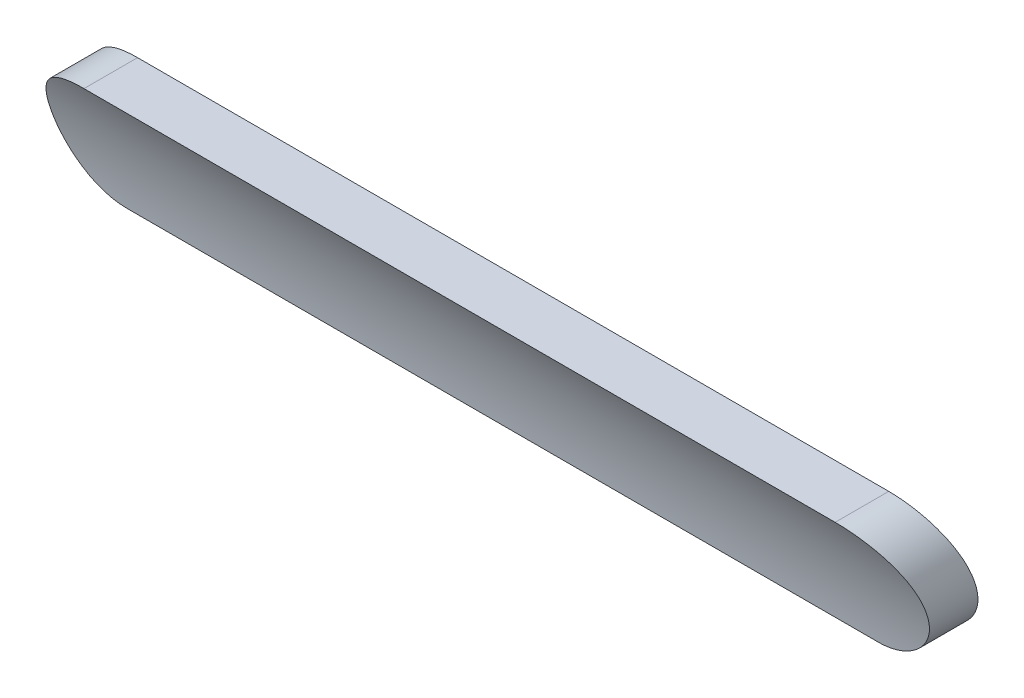
ISO-10303-21;
HEADER;
FILE_DESCRIPTION(('STEP AP214'),'2;1');
FILE_NAME('part.step','',(''),(''),'','','');
FILE_SCHEMA(('AUTOMOTIVE_DESIGN { 1 0 10303 214 1 1 1 1 }'));
ENDSEC;
DATA;
#1=APPLICATION_CONTEXT('core data for automotive mechanical design processes');
#2=APPLICATION_PROTOCOL_DEFINITION('international standard','automotive_design',2000,#1);
#3=PRODUCT_CONTEXT('',#1,'mechanical');
#4=PRODUCT('Part','Part','',(#3));
#5=PRODUCT_RELATED_PRODUCT_CATEGORY('part','',(#4));
#6=PRODUCT_DEFINITION_FORMATION('','',#4);
#7=PRODUCT_DEFINITION_CONTEXT('part definition',#1,'design');
#8=PRODUCT_DEFINITION('design','',#6,#7);
#9=PRODUCT_DEFINITION_SHAPE('','',#8);
#10=(LENGTH_UNIT() NAMED_UNIT(*) SI_UNIT(.MILLI.,.METRE.));
#11=(NAMED_UNIT(*) PLANE_ANGLE_UNIT() SI_UNIT($,.RADIAN.));
#12=(NAMED_UNIT(*) SI_UNIT($,.STERADIAN.) SOLID_ANGLE_UNIT());
#13=UNCERTAINTY_MEASURE_WITH_UNIT(LENGTH_MEASURE(1.E-05),#10,'distance_accuracy_value','');
#14=(GEOMETRIC_REPRESENTATION_CONTEXT(3) GLOBAL_UNCERTAINTY_ASSIGNED_CONTEXT((#13)) GLOBAL_UNIT_ASSIGNED_CONTEXT((#10,
#11,#12)) REPRESENTATION_CONTEXT('',''));
#15=CARTESIAN_POINT('',(0.,0.,0.));
#16=DIRECTION('',(0.,0.,1.));
#17=DIRECTION('',(1.,0.,0.));
#18=AXIS2_PLACEMENT_3D('',#15,#16,#17);
#19=CARTESIAN_POINT('',(-43.,18.3856217223385,27.5));
#20=DIRECTION('',(1.,0.,0.));
#21=DIRECTION('',(0.,1.,0.));
#22=AXIS2_PLACEMENT_3D('',#19,#20,#21);
#23=CYLINDRICAL_SURFACE('',#22,11.5);
#24=DIRECTION('',(1.,0.,0.));
#25=VECTOR('',#24,1.);
#26=CARTESIAN_POINT('',(-43.,19.5593126413769,16.0600502786696));
#27=LINE('',#26,#25);
#28=CARTESIAN_POINT('',(12.,19.5593126413769,16.0600502786696));
#29=VERTEX_POINT('',#28);
#30=CARTESIAN_POINT('',(-12.,19.5593126413769,16.0600502786696));
#31=VERTEX_POINT('',#30);
#32=EDGE_CURVE('E84',#29,#31,#27,.F.);
#33=ORIENTED_EDGE('',*,*,#32,.T.);
#34=CARTESIAN_POINT('',(-12.,19.5593126413769,16.0600502786696));
#35=CARTESIAN_POINT('',(-12.0559285526636,19.5593128899921,16.0600526617604));
#36=CARTESIAN_POINT('',(-12.1118303578771,19.5616601426017,16.060290856371));
#37=CARTESIAN_POINT('',(-12.2232349348033,19.5710234384487,16.0612563880741));
#38=CARTESIAN_POINT('',(-12.2787377228446,19.578039289526,16.0619837050343));
#39=CARTESIAN_POINT('',(-12.4439683748062,19.6060237817033,16.0649226593198));
#40=CARTESIAN_POINT('',(-12.5525908726804,19.633929536962,16.067891202933));
#41=CARTESIAN_POINT('',(-12.7635817203032,19.7074361933977,16.0761583372901));
#42=CARTESIAN_POINT('',(-12.8659468271745,19.7530461812516,16.0814581247285));
#43=CARTESIAN_POINT('',(-13.0614957632456,19.8605876513694,16.0948520577075));
#44=CARTESIAN_POINT('',(-13.1546818818505,19.9225150495433,16.1029455041793));
#45=CARTESIAN_POINT('',(-13.329125600699,20.060715456582,16.1224383812117));
#46=CARTESIAN_POINT('',(-13.41039876509,20.1369694450955,16.1338334392195));
#47=CARTESIAN_POINT('',(-13.5589313652079,20.3015292403939,16.1604131269398));
#48=CARTESIAN_POINT('',(-13.6261890973485,20.3898365101076,16.175598216841));
#49=CARTESIAN_POINT('',(-13.7449922959549,20.575852166843,16.2101003530093));
#50=CARTESIAN_POINT('',(-13.7965210451782,20.6735704120803,16.2294217586413));
#51=CARTESIAN_POINT('',(-13.8826065038741,20.8753349982163,16.2722683904398));
#52=CARTESIAN_POINT('',(-13.9171634267096,20.9793812595431,16.2957935637533));
#53=CARTESIAN_POINT('',(-13.9691821648242,21.1925016361603,16.3472590497404));
#54=CARTESIAN_POINT('',(-13.9863547393739,21.3016301872831,16.3752653607104));
#55=CARTESIAN_POINT('',(-14.0026224739232,21.5202447024914,16.4348752634515));
#56=CARTESIAN_POINT('',(-14.0017137637445,21.6297307380797,16.4664796239218));
#57=CARTESIAN_POINT('',(-13.9819047743035,21.8505599845523,16.5337770957174));
#58=CARTESIAN_POINT('',(-13.9622929894756,21.9618048712774,16.5695826019585));
#59=CARTESIAN_POINT('',(-13.9049246917206,22.1788905713666,16.6430087118456));
#60=CARTESIAN_POINT('',(-13.8671631108601,22.2847298662004,16.6806298198175));
#61=CARTESIAN_POINT('',(-13.7724363579415,22.4932151856639,16.7579983736407));
#62=CARTESIAN_POINT('',(-13.714667604276,22.5954902653303,16.7977640145915));
#63=CARTESIAN_POINT('',(-13.5818194501711,22.7887857189098,16.8758281660174));
#64=CARTESIAN_POINT('',(-13.5067363543697,22.8798036838617,16.9141263612612));
#65=CARTESIAN_POINT('',(-13.3402846815033,23.0485318751457,16.9873508347498));
#66=CARTESIAN_POINT('',(-13.2488097711798,23.1261482916625,17.0222526515805));
#67=CARTESIAN_POINT('',(-13.0519591270749,23.2645501082547,17.0859765673153));
#68=CARTESIAN_POINT('',(-12.9465854500412,23.3253379945095,17.1147995641298));
#69=CARTESIAN_POINT('',(-12.7324031130105,23.4238607169949,17.1622561240667));
#70=CARTESIAN_POINT('',(-12.6243071494001,23.4628752795586,17.1814464080677));
#71=CARTESIAN_POINT('',(-12.4019900460303,23.5218480911816,17.2106709344513));
#72=CARTESIAN_POINT('',(-12.2877862135015,23.5418574551575,17.2207297329283));
#73=CARTESIAN_POINT('',(-12.1439866234115,23.554333549305,17.2270054981875));
#74=CARTESIAN_POINT('',(-12.1152094302447,23.5562009881607,17.2279452605755));
#75=CARTESIAN_POINT('',(-12.0576257961727,23.5586885499141,17.2291974525529));
#76=CARTESIAN_POINT('',(-12.02881944477,23.559310324901,17.2295107130533));
#77=CARTESIAN_POINT('',(-12.,23.5593126413769,17.2295120722401));
#78=B_SPLINE_CURVE_WITH_KNOTS('',3,(#34,#35,#36,#37,#38,#39,#40,#41,#42,#43,#44,#45,#46,#47,#48,
#49,#50,#51,#52,#53,#54,#55,#56,#57,#58,#59,#60,#61,#62,#63,#64,#65,#66,#67,#68,#69,#70,#71,#72,
#73,#74,#75,#76,#77),.UNSPECIFIED.,.F.,.F.,(4,2,2,2,2,2,2,2,2,2,2,2,2,2,2,2,2,2,2,2,2,4),(0.,
0.167682751683179,0.335358601949008,0.670199836117139,1.00521315488309,1.34014270257469,
1.6746306916783,2.00915931436168,2.34404225612738,2.67892098777065,3.01928413449512,
3.35972013446241,3.71364622332205,4.0676711957621,4.43798401596731,4.80837594448991,
5.18126382861749,5.55409659435126,5.90174782077204,6.24846136130122,6.33499999246368,
6.42142377366484),.UNSPECIFIED.);
#79=CARTESIAN_POINT('',(-12.,23.5593126413769,17.2295120722402));
#80=VERTEX_POINT('',#79);
#81=EDGE_CURVE('E12',#31,#80,#78,.T.);
#82=ORIENTED_EDGE('',*,*,#81,.T.);
#83=DIRECTION('',(1.,0.,0.));
#84=VECTOR('',#83,1.);
#85=CARTESIAN_POINT('',(-43.,23.5593126413769,17.2295120722402));
#86=LINE('',#85,#84);
#87=CARTESIAN_POINT('',(12.,23.5593126413769,17.2295120722402));
#88=VERTEX_POINT('',#87);
#89=EDGE_CURVE('E54',#80,#88,#86,.T.);
#90=ORIENTED_EDGE('',*,*,#89,.T.);
#91=CARTESIAN_POINT('',(12.,23.5593126413769,17.2295120722402));
#92=CARTESIAN_POINT('',(12.0524354843168,23.5593209989085,17.2295194970277));
#93=CARTESIAN_POINT('',(12.1048655115046,23.5572507521347,17.2284734849482));
#94=CARTESIAN_POINT('',(12.2093036192198,23.5490176645812,17.2243306276688));
#95=CARTESIAN_POINT('',(12.2613118425702,23.5428562730956,17.2212345087233));
#96=CARTESIAN_POINT('',(12.3643202502182,23.5265391270392,17.2130642792589));
#97=CARTESIAN_POINT('',(12.4153237060749,23.5163999425333,17.2079983749305));
#98=CARTESIAN_POINT('',(12.5161696241218,23.4922536403998,17.1959963409351));
#99=CARTESIAN_POINT('',(12.5660120266315,23.4782463244157,17.1890601153591));
#100=CARTESIAN_POINT('',(12.713189277879,23.4306648301928,17.1656494428949));
#101=CARTESIAN_POINT('',(12.8083710619894,23.3914993222692,17.1465566898183));
#102=CARTESIAN_POINT('',(12.9906013629162,23.2997578008255,17.1027004658034));
#103=CARTESIAN_POINT('',(13.0776426664355,23.2471700448184,17.0779320314303));
#104=CARTESIAN_POINT('',(13.2463365439185,23.1270886396424,17.0227352279635));
#105=CARTESIAN_POINT('',(13.3274531681165,23.0589489804429,16.9920752494738));
#106=CARTESIAN_POINT('',(13.4773841178339,22.9114981426027,16.9277290280852));
#107=CARTESIAN_POINT('',(13.5461941857663,22.8321831146225,16.8940417438894));
#108=CARTESIAN_POINT('',(13.6761717340021,22.6563476592904,16.8219508746647));
#109=CARTESIAN_POINT('',(13.7360233425126,22.5589119495781,16.7834007977195));
#110=CARTESIAN_POINT('',(13.8383238893064,22.3552750474105,16.7063116564349));
#111=CARTESIAN_POINT('',(13.8807682047148,22.2490715354641,16.6677725977337));
#112=CARTESIAN_POINT('',(13.9483810091638,22.0261159479928,16.5907729148156));
#113=CARTESIAN_POINT('',(13.9727992802337,21.9091127415822,16.5523757616064));
#114=CARTESIAN_POINT('',(14.0004165330867,21.6716338496496,16.4787674884444));
#115=CARTESIAN_POINT('',(14.0036180567871,21.5511585818422,16.4435559873266));
#116=CARTESIAN_POINT('',(13.9883145058049,21.3135291588439,16.3783028185425));
#117=CARTESIAN_POINT('',(13.9703692126521,21.1963697660377,16.3481509146335));
#118=CARTESIAN_POINT('',(13.913653038445,20.9660279489257,16.2926126127176));
#119=CARTESIAN_POINT('',(13.874888641152,20.8528442981274,16.2672247343548));
#120=CARTESIAN_POINT('',(13.7796779513575,20.6396886995673,16.2225675441641));
#121=CARTESIAN_POINT('',(13.7241799766683,20.5393422660756,16.2030612751318));
#122=CARTESIAN_POINT('',(13.5964153417868,20.3491155937936,16.1684490387775));
#123=CARTESIAN_POINT('',(13.5241520186411,20.2592332775204,16.1533421971224));
#124=CARTESIAN_POINT('',(13.3673073680147,20.0954321384437,16.1275228711276));
#125=CARTESIAN_POINT('',(13.2831602523089,20.0211155368796,16.116692228758));
#126=CARTESIAN_POINT('',(13.103367920785,19.8874500458663,16.0982861603434));
#127=CARTESIAN_POINT('',(13.0077205666457,19.8281039463639,16.0907113408783));
#128=CARTESIAN_POINT('',(12.8083745080906,19.7265629917135,16.0783326206371));
#129=CARTESIAN_POINT('',(12.7047329342229,19.6842578306695,16.0735108118854));
#130=CARTESIAN_POINT('',(12.4918362956703,19.6175334049056,16.0661233153119));
#131=CARTESIAN_POINT('',(12.3825881332188,19.593092687064,16.063554920656));
#132=CARTESIAN_POINT('',(12.2270491424421,19.5717175094995,16.0613285901579));
#133=CARTESIAN_POINT('',(12.1817222829736,19.5670638114558,16.0608476901848));
#134=CARTESIAN_POINT('',(12.0909369842824,19.5608651727453,16.0602092986241));
#135=CARTESIAN_POINT('',(12.0454789343514,19.5593145929351,16.0600512203779));
#136=CARTESIAN_POINT('',(12.,19.5593126413769,16.0600502786696));
#137=B_SPLINE_CURVE_WITH_KNOTS('',3,(#91,#92,#93,#94,#95,#96,#97,#98,#99,#100,#101,#102,#103,
#104,#105,#106,#107,#108,#109,#110,#111,#112,#113,#114,#115,#116,#117,#118,#119,#120,#121,#122,
#123,#124,#125,#126,#127,#128,#129,#130,#131,#132,#133,#134,#135,#136),.UNSPECIFIED.,.F.,.F.,(4,
2,2,2,2,2,2,2,2,2,2,2,2,2,2,2,2,2,2,2,2,2,4),(0.,0.157246055927389,0.314436436902916,
0.470978855312609,0.627529302656159,0.940037479781896,1.25281999821495,1.58230484983462,
1.91190347075018,2.27231530450047,2.63282279135432,3.00759826482692,3.38232883672084,
3.74735861432656,4.11227477538749,4.45949995130471,4.80665607324258,5.14340512805026,
5.48021689411647,5.81481202355203,6.14900467996104,6.28562159457819,6.42199001576959),.UNSPECIFIED.);
#138=EDGE_CURVE('E88',#88,#29,#137,.T.);
#139=ORIENTED_EDGE('',*,*,#138,.T.);
#140=EDGE_LOOP('',(#33,#82,#90,#139));
#141=FACE_BOUND('',#140,.T.);
#142=ADVANCED_FACE('F40',(#141),#23,.T.);
#143=CARTESIAN_POINT('',(-12.,21.5593126413769,0.));
#144=DIRECTION('',(0.,0.,1.));
#145=DIRECTION('',(1.,0.,0.));
#146=AXIS2_PLACEMENT_3D('',#143,#144,#145);
#147=CYLINDRICAL_SURFACE('',#146,2.);
#148=CARTESIAN_POINT('',(-12.,19.5593126413769,17.5691163723178));
#149=CARTESIAN_POINT('',(-12.0558186378886,19.5593128503807,17.5691191003802));
#150=CARTESIAN_POINT('',(-12.1116105964309,19.5616509335577,17.5693924201576));
#151=CARTESIAN_POINT('',(-12.2227965776448,19.5709773795937,17.5705002913921));
#152=CARTESIAN_POINT('',(-12.2781906157479,19.5779655611244,17.5713348209652));
#153=CARTESIAN_POINT('',(-12.4431007354684,19.6058394670533,17.5747069546148));
#154=CARTESIAN_POINT('',(-12.5515140759764,19.6336347261937,17.5781129942352));
#155=CARTESIAN_POINT('',(-12.7621009776826,19.7068408093969,17.5875973425139));
#156=CARTESIAN_POINT('',(-12.8642712017863,19.7522609606786,17.5936770663325));
#157=CARTESIAN_POINT('',(-13.0594438644259,19.8593256354635,17.6090390091433));
#158=CARTESIAN_POINT('',(-13.1524487475646,19.9209658165331,17.618320371198));
#159=CARTESIAN_POINT('',(-13.3265140052937,20.0584328575878,17.6406629352448));
#160=CARTESIAN_POINT('',(-13.4075949961278,20.1342347043664,17.6537174946896));
#161=CARTESIAN_POINT('',(-13.5557980577956,20.2977008664765,17.6841530896471));
#162=CARTESIAN_POINT('',(-13.6229185484796,20.3853665227876,17.7015346144281));
#163=CARTESIAN_POINT('',(-13.7415729825687,20.569882518554,17.7410090799785));
#164=CARTESIAN_POINT('',(-13.7930857337993,20.6667451134548,17.7631083577671));
#165=CARTESIAN_POINT('',(-13.8793294027949,20.8665199373655,17.8120840439916));
#166=CARTESIAN_POINT('',(-13.9140602663572,20.9694321859135,17.8389604678566));
#167=CARTESIAN_POINT('',(-13.9668726556523,21.180500702806,17.8978698849258));
#168=CARTESIAN_POINT('',(-13.984584061567,21.2887219657725,17.9300004601534));
#169=CARTESIAN_POINT('',(-14.0022230840771,21.5052977263711,17.9983932551317));
#170=CARTESIAN_POINT('',(-14.0021460521431,21.6136522514302,18.0346565523836));
#171=CARTESIAN_POINT('',(-13.9843532704834,21.8333849343242,18.1123911008972));
#172=CARTESIAN_POINT('',(-13.9657202800007,21.9446272201679,18.1540351290125));
#173=CARTESIAN_POINT('',(-13.9104347611334,22.1616326639197,18.2395806481576));
#174=CARTESIAN_POINT('',(-13.8737761029418,22.2673939444242,18.2834829025692));
#175=CARTESIAN_POINT('',(-13.7806914430576,22.4775510752036,18.3747578814077));
#176=CARTESIAN_POINT('',(-13.7231670734114,22.5814425674397,18.4221751978352));
#177=CARTESIAN_POINT('',(-13.5902992211597,22.7779283773308,18.5155971971598));
#178=CARTESIAN_POINT('',(-13.5149484878019,22.8705180747655,18.5616012966151));
#179=CARTESIAN_POINT('',(-13.3465537415976,23.0430683650361,18.6502687644887));
#180=CARTESIAN_POINT('',(-13.2532643951378,23.1228217882416,18.69287262007));
#181=CARTESIAN_POINT('',(-13.0515878311434,23.2650015956361,18.7708395652559));
#182=CARTESIAN_POINT('',(-12.9432058436553,23.327433959754,18.8062051526942));
#183=CARTESIAN_POINT('',(-12.7242289471348,23.42709477122,18.8636466827237));
#184=CARTESIAN_POINT('',(-12.614680173153,23.466065715832,18.8866222319054));
#185=CARTESIAN_POINT('',(-12.445573185472,23.5099198444802,18.9126929408013));
#186=CARTESIAN_POINT('',(-12.3884558478133,23.5221001379888,18.9199818517843));
#187=CARTESIAN_POINT('',(-12.2730948847572,23.5414396743618,18.9315886144298));
#188=CARTESIAN_POINT('',(-12.2148522167255,23.5486030074537,18.9359088863099));
#189=CARTESIAN_POINT('',(-12.1303536513415,23.5552311094573,18.9399098808806));
#190=CARTESIAN_POINT('',(-12.1042982223485,23.5567619947272,18.9408347392652));
#191=CARTESIAN_POINT('',(-12.0521635236314,23.5588020822309,18.9420676480722));
#192=CARTESIAN_POINT('',(-12.0260843178951,23.5593124828541,18.9423764219827));
#193=CARTESIAN_POINT('',(-12.,23.5593126413769,18.9423763652366));
#194=B_SPLINE_CURVE_WITH_KNOTS('',3,(#148,#149,#150,#151,#152,#153,#154,#155,#156,#157,#158,
#159,#160,#161,#162,#163,#164,#165,#166,#167,#168,#169,#170,#171,#172,#173,#174,#175,#176,#177,
#178,#179,#180,#181,#182,#183,#184,#185,#186,#187,#188,#189,#190,#191,#192,#193),.UNSPECIFIED.,
.F.,.F.,(4,2,2,2,2,2,2,2,2,2,2,2,2,2,2,2,2,2,2,2,2,2,4),(0.,0.167353259160271,0.334699992843444,
0.668892150996066,1.00326140775849,1.33754123795188,1.67123613077299,2.004968773049,
2.33915254719994,2.67333740070174,3.01463544890446,3.35602268626868,3.71516662439334,
4.07443277752645,4.45629768977307,4.83831819082954,5.22599204934921,5.61353190017509,
5.96674882364495,6.14306734423376,6.31924194799777,6.39756996368798,6.47580594199601),.UNSPECIFIED.);
#195=CARTESIAN_POINT('',(-12.,19.5593126413769,17.5691163723178));
#196=VERTEX_POINT('',#195);
#197=CARTESIAN_POINT('',(-12.,23.5593126413769,18.9423763652367));
#198=VERTEX_POINT('',#197);
#199=EDGE_CURVE('E89',#196,#198,#194,.T.);
#200=ORIENTED_EDGE('',*,*,#199,.T.);
#201=DIRECTION('',(0.,0.,1.));
#202=VECTOR('',#201,1.);
#203=CARTESIAN_POINT('',(-12.,23.5593126413769,0.));
#204=LINE('',#203,#202);
#205=EDGE_CURVE('E142',#80,#198,#204,.T.);
#206=ORIENTED_EDGE('',*,*,#205,.F.);
#207=ORIENTED_EDGE('',*,*,#81,.F.);
#208=DIRECTION('',(0.,0.,1.));
#209=VECTOR('',#208,1.);
#210=CARTESIAN_POINT('',(-12.,19.5593126413769,0.));
#211=LINE('',#210,#209);
#212=EDGE_CURVE('E66',#31,#196,#211,.T.);
#213=ORIENTED_EDGE('',*,*,#212,.T.);
#214=EDGE_LOOP('',(#200,#206,#207,#213));
#215=FACE_BOUND('',#214,.T.);
#216=ADVANCED_FACE('F129',(#215),#147,.T.);
#217=CARTESIAN_POINT('',(-12.,23.5593126413769,0.));
#218=DIRECTION('',(0.,1.,0.));
#219=DIRECTION('',(-1.,0.,0.));
#220=AXIS2_PLACEMENT_3D('',#217,#218,#219);
#221=PLANE('',#220);
#222=DIRECTION('',(1.,0.,0.));
#223=VECTOR('',#222,1.);
#224=CARTESIAN_POINT('',(-43.,23.5593126413769,18.9423763652367));
#225=LINE('',#224,#223);
#226=CARTESIAN_POINT('',(12.,23.5593126413769,18.9423763652367));
#227=VERTEX_POINT('',#226);
#228=EDGE_CURVE('E122',#198,#227,#225,.T.);
#229=ORIENTED_EDGE('',*,*,#228,.T.);
#230=DIRECTION('',(0.,0.,1.));
#231=VECTOR('',#230,1.);
#232=CARTESIAN_POINT('',(12.,23.5593126413769,0.));
#233=LINE('',#232,#231);
#234=EDGE_CURVE('E98',#88,#227,#233,.T.);
#235=ORIENTED_EDGE('',*,*,#234,.F.);
#236=ORIENTED_EDGE('',*,*,#89,.F.);
#237=ORIENTED_EDGE('',*,*,#205,.T.);
#238=EDGE_LOOP('',(#229,#235,#236,#237));
#239=FACE_BOUND('',#238,.T.);
#240=ADVANCED_FACE('F113',(#239),#221,.T.);
#241=CARTESIAN_POINT('',(12.,21.5593126413769,0.));
#242=DIRECTION('',(0.,0.,1.));
#243=DIRECTION('',(1.,0.,0.));
#244=AXIS2_PLACEMENT_3D('',#241,#242,#243);
#245=CYLINDRICAL_SURFACE('',#244,2.00000000000001);
#246=CARTESIAN_POINT('',(12.,23.5593126413769,18.9423763652367));
#247=CARTESIAN_POINT('',(12.0511423673233,23.5593218848065,18.9423857354606));
#248=CARTESIAN_POINT('',(12.1022781331261,23.5573512663024,18.9411906598273));
#249=CARTESIAN_POINT('',(12.204118693099,23.5495218766949,18.9364625749664));
#250=CARTESIAN_POINT('',(12.2548236804987,23.5436649534738,18.9329306768667));
#251=CARTESIAN_POINT('',(12.3551704462668,23.5281751246813,18.9236242479482));
#252=CARTESIAN_POINT('',(12.4048164059048,23.5185621826158,18.917861575329));
#253=CARTESIAN_POINT('',(12.5029558881152,23.4956952006796,18.9042262856153));
#254=CARTESIAN_POINT('',(12.5514493212786,23.4824408793185,18.8963535054038));
#255=CARTESIAN_POINT('',(12.694561072501,23.4374896556465,18.869829119919));
#256=CARTESIAN_POINT('',(12.7870591104883,23.4005652553907,18.8482473015538));
#257=CARTESIAN_POINT('',(12.9642626999385,23.3142902750979,18.7988111998191));
#258=CARTESIAN_POINT('',(13.0489585459858,23.2649244963823,18.7709492489229));
#259=CARTESIAN_POINT('',(13.2148033772366,23.15149210063,18.7084727696235));
#260=CARTESIAN_POINT('',(13.2952845033694,23.0866360147777,18.6735212422503));
#261=CARTESIAN_POINT('',(13.4445575544618,22.9463100309326,18.6002026413294));
#262=CARTESIAN_POINT('',(13.5133453607732,22.8708364102427,18.56183437155));
#263=CARTESIAN_POINT('',(13.6463933494827,22.7005873645289,18.4782950075163));
#264=CARTESIAN_POINT('',(13.7089297917903,22.6045779286716,18.4328841387943));
#265=CARTESIAN_POINT('',(13.8167684636936,22.4033466468923,18.3419386616807));
#266=CARTESIAN_POINT('',(13.8620635655371,22.2981210129615,18.2964040099335));
#267=CARTESIAN_POINT('',(13.9362640672998,22.0745970620389,18.2044709965694));
#268=CARTESIAN_POINT('',(13.9640874281703,21.9558954472078,18.1581714785677));
#269=CARTESIAN_POINT('',(13.9977376337709,21.7140393533424,18.069293860888));
#270=CARTESIAN_POINT('',(14.0035680945695,21.5908856096885,18.0267151505601));
#271=CARTESIAN_POINT('',(13.9923937788306,21.3480023153909,17.9480337446683));
#272=CARTESIAN_POINT('',(13.9761351881408,21.2282936657534,17.9117638767138));
#273=CARTESIAN_POINT('',(13.9217528025701,20.9922952980168,17.8449351219588));
#274=CARTESIAN_POINT('',(13.8836387713225,20.8760040775967,17.8143736930648));
#275=CARTESIAN_POINT('',(13.7893492421469,20.6585684994981,17.7611379189714));
#276=CARTESIAN_POINT('',(13.7345269065139,20.5569309753337,17.7380769742794));
#277=CARTESIAN_POINT('',(13.6075996241231,20.3639249248749,17.6971404691315));
#278=CARTESIAN_POINT('',(13.5354991612658,20.2725537433516,17.6792635660045));
#279=CARTESIAN_POINT('',(13.3793637049146,20.1068021548844,17.6488901788907));
#280=CARTESIAN_POINT('',(13.2959436847192,20.031876357305,17.6362021733645));
#281=CARTESIAN_POINT('',(13.1174219670542,19.8968169152813,17.6146077017113));
#282=CARTESIAN_POINT('',(13.0223186135653,19.8366853714401,17.6057017724626));
#283=CARTESIAN_POINT('',(12.8241612632282,19.733628624109,17.5911367605218));
#284=CARTESIAN_POINT('',(12.7211915877824,19.6905450462231,17.5854475712084));
#285=CARTESIAN_POINT('',(12.5094770904419,19.6221040592463,17.5766781164725));
#286=CARTESIAN_POINT('',(12.4007388043522,19.5967270315268,17.5735949627927));
#287=CARTESIAN_POINT('',(12.2425819126388,19.5734789904663,17.5707989361103));
#288=CARTESIAN_POINT('',(12.1941736986819,19.5681648392093,17.5701657665926));
#289=CARTESIAN_POINT('',(12.097184228798,19.5610857328665,17.5693256183585));
#290=CARTESIAN_POINT('',(12.0486034550315,19.559314266535,17.5691178577488));
#291=CARTESIAN_POINT('',(12.,19.5593126413769,17.5691163723178));
#292=B_SPLINE_CURVE_WITH_KNOTS('',3,(#246,#247,#248,#249,#250,#251,#252,#253,#254,#255,#256,
#257,#258,#259,#260,#261,#262,#263,#264,#265,#266,#267,#268,#269,#270,#271,#272,#273,#274,#275,
#276,#277,#278,#279,#280,#281,#282,#283,#284,#285,#286,#287,#288,#289,#290,#291),.UNSPECIFIED.,
.F.,.F.,(4,2,2,2,2,2,2,2,2,2,2,2,2,2,2,2,2,2,2,2,2,2,4),(0.,0.153364289194259,0.306655708066227,
0.459143219133052,0.611642521295218,0.915893247043381,1.22051746963294,1.5465555975475,
1.87270832648374,2.24086118373496,2.60916607439136,2.99847565970615,3.38772123202059,
3.76413951698748,4.14038977285327,4.49188768980206,4.84329448703032,5.18020594122388,
5.51716520514725,5.85091620186606,6.18429681705358,6.33029782922299,6.47603025262317),.UNSPECIFIED.);
#293=CARTESIAN_POINT('',(12.,19.5593126413769,17.5691163723178));
#294=VERTEX_POINT('',#293);
#295=EDGE_CURVE('E96',#227,#294,#292,.T.);
#296=ORIENTED_EDGE('',*,*,#295,.T.);
#297=DIRECTION('',(0.,0.,1.));
#298=VECTOR('',#297,1.);
#299=CARTESIAN_POINT('',(12.,19.5593126413769,0.));
#300=LINE('',#299,#298);
#301=EDGE_CURVE('E61',#29,#294,#300,.T.);
#302=ORIENTED_EDGE('',*,*,#301,.F.);
#303=ORIENTED_EDGE('',*,*,#138,.F.);
#304=ORIENTED_EDGE('',*,*,#234,.T.);
#305=EDGE_LOOP('',(#296,#302,#303,#304));
#306=FACE_BOUND('',#305,.T.);
#307=ADVANCED_FACE('F92',(#306),#245,.T.);
#308=CARTESIAN_POINT('',(-12.,19.5593126413769,0.));
#309=DIRECTION('',(0.,-1.,0.));
#310=DIRECTION('',(1.,0.,0.));
#311=AXIS2_PLACEMENT_3D('',#308,#309,#310);
#312=PLANE('',#311);
#313=DIRECTION('',(1.,0.,0.));
#314=VECTOR('',#313,1.);
#315=CARTESIAN_POINT('',(-43.,19.5593126413769,17.5691163723178));
#316=LINE('',#315,#314);
#317=EDGE_CURVE('E123',#294,#196,#316,.F.);
#318=ORIENTED_EDGE('',*,*,#317,.T.);
#319=ORIENTED_EDGE('',*,*,#212,.F.);
#320=ORIENTED_EDGE('',*,*,#32,.F.);
#321=ORIENTED_EDGE('',*,*,#301,.T.);
#322=EDGE_LOOP('',(#318,#319,#320,#321));
#323=FACE_BOUND('',#322,.T.);
#324=ADVANCED_FACE('F85',(#323),#312,.T.);
#325=CARTESIAN_POINT('',(-43.,18.3856217223385,27.5));
#326=DIRECTION('',(1.,0.,0.));
#327=DIRECTION('',(0.,1.,0.));
#328=AXIS2_PLACEMENT_3D('',#325,#326,#327);
#329=CYLINDRICAL_SURFACE('',#328,10.);
#330=ORIENTED_EDGE('',*,*,#199,.F.);
#331=ORIENTED_EDGE('',*,*,#317,.F.);
#332=ORIENTED_EDGE('',*,*,#295,.F.);
#333=ORIENTED_EDGE('',*,*,#228,.F.);
#334=EDGE_LOOP('',(#330,#331,#332,#333));
#335=FACE_BOUND('',#334,.T.);
#336=ADVANCED_FACE('F42',(#335),#329,.F.);
#337=CLOSED_SHELL('',(#142,#216,#240,#307,#324,#336));
#338=MANIFOLD_SOLID_BREP('B2',#337);
#339=ADVANCED_BREP_SHAPE_REPRESENTATION('',(#18,#338),#14);
#340=SHAPE_DEFINITION_REPRESENTATION(#9,#339);
ENDSEC;
END-ISO-10303-21;
